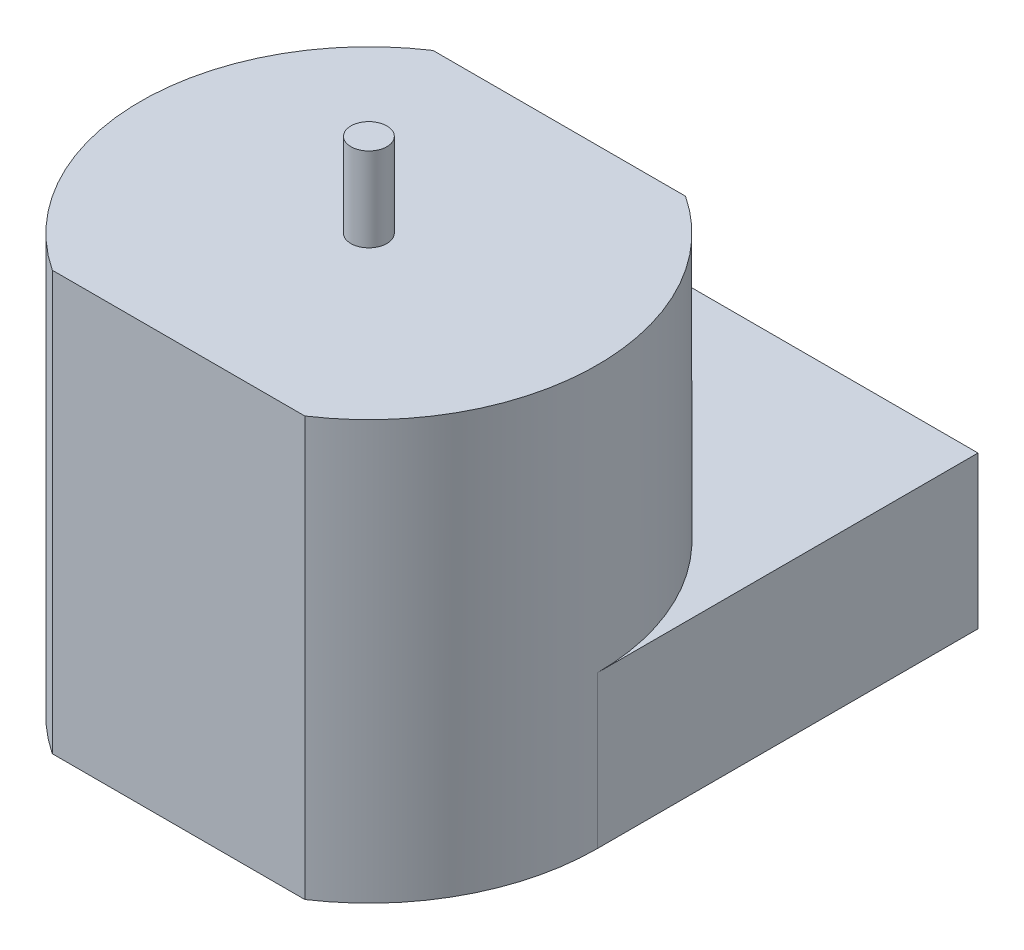
ISO-10303-21;
HEADER;
FILE_DESCRIPTION(('STEP AP214'),'2;1');
FILE_NAME('part.step','',(''),(''),'','','');
FILE_SCHEMA(('AUTOMOTIVE_DESIGN { 1 0 10303 214 1 1 1 1 }'));
ENDSEC;
DATA;
#1=APPLICATION_CONTEXT('core data for automotive mechanical design processes');
#2=APPLICATION_PROTOCOL_DEFINITION('international standard','automotive_design',2000,#1);
#3=PRODUCT_CONTEXT('',#1,'mechanical');
#4=PRODUCT('Part','Part','',(#3));
#5=PRODUCT_RELATED_PRODUCT_CATEGORY('part','',(#4));
#6=PRODUCT_DEFINITION_FORMATION('','',#4);
#7=PRODUCT_DEFINITION_CONTEXT('part definition',#1,'design');
#8=PRODUCT_DEFINITION('design','',#6,#7);
#9=PRODUCT_DEFINITION_SHAPE('','',#8);
#10=(LENGTH_UNIT() NAMED_UNIT(*) SI_UNIT(.MILLI.,.METRE.));
#11=(NAMED_UNIT(*) PLANE_ANGLE_UNIT() SI_UNIT($,.RADIAN.));
#12=(NAMED_UNIT(*) SI_UNIT($,.STERADIAN.) SOLID_ANGLE_UNIT());
#13=UNCERTAINTY_MEASURE_WITH_UNIT(LENGTH_MEASURE(1.E-05),#10,'distance_accuracy_value','');
#14=(GEOMETRIC_REPRESENTATION_CONTEXT(3) GLOBAL_UNCERTAINTY_ASSIGNED_CONTEXT((#13)) GLOBAL_UNIT_ASSIGNED_CONTEXT((#10,
#11,#12)) REPRESENTATION_CONTEXT('',''));
#15=CARTESIAN_POINT('',(0.,0.,0.));
#16=DIRECTION('',(0.,0.,1.));
#17=DIRECTION('',(1.,0.,0.));
#18=AXIS2_PLACEMENT_3D('',#15,#16,#17);
#19=CARTESIAN_POINT('',(0.,6.35,7.9375));
#20=DIRECTION('',(0.,0.,-1.));
#21=DIRECTION('',(-1.,0.,0.));
#22=AXIS2_PLACEMENT_3D('',#19,#20,#21);
#23=PLANE('',#22);
#24=DIRECTION('',(1.,0.,0.));
#25=VECTOR('',#24,1.);
#26=CARTESIAN_POINT('',(0.,0.,7.9375));
#27=LINE('',#26,#25);
#28=CARTESIAN_POINT('',(-5.2651418546892,0.,7.9375));
#29=VERTEX_POINT('',#28);
#30=CARTESIAN_POINT('',(5.2651418546892,0.,7.9375));
#31=VERTEX_POINT('',#30);
#32=EDGE_CURVE('E142',#29,#31,#27,.T.);
#33=ORIENTED_EDGE('',*,*,#32,.T.);
#34=DIRECTION('',(0.,-1.,0.));
#35=VECTOR('',#34,1.);
#36=CARTESIAN_POINT('',(5.2651418546892,6.35,7.9375));
#37=LINE('',#36,#35);
#38=CARTESIAN_POINT('',(5.2651418546892,17.4625,7.9375));
#39=VERTEX_POINT('',#38);
#40=EDGE_CURVE('E39',#39,#31,#37,.T.);
#41=ORIENTED_EDGE('',*,*,#40,.F.);
#42=DIRECTION('',(1.,0.,0.));
#43=VECTOR('',#42,1.);
#44=CARTESIAN_POINT('',(0.,17.4625,7.9375));
#45=LINE('',#44,#43);
#46=CARTESIAN_POINT('',(-5.2651418546892,17.4625,7.9375));
#47=VERTEX_POINT('',#46);
#48=EDGE_CURVE('E117',#47,#39,#45,.T.);
#49=ORIENTED_EDGE('',*,*,#48,.F.);
#50=DIRECTION('',(0.,-1.,0.));
#51=VECTOR('',#50,1.);
#52=CARTESIAN_POINT('',(-5.2651418546892,6.35,7.9375));
#53=LINE('',#52,#51);
#54=EDGE_CURVE('E105',#47,#29,#53,.T.);
#55=ORIENTED_EDGE('',*,*,#54,.T.);
#56=EDGE_LOOP('',(#33,#41,#49,#55));
#57=FACE_BOUND('',#56,.T.);
#58=ADVANCED_FACE('F36',(#57),#23,.F.);
#59=CARTESIAN_POINT('',(0.,6.35,0.));
#60=DIRECTION('',(0.,-1.,0.));
#61=DIRECTION('',(0.,0.,-1.));
#62=AXIS2_PLACEMENT_3D('',#59,#60,#61);
#63=CYLINDRICAL_SURFACE('',#62,9.525);
#64=CARTESIAN_POINT('',(0.,0.,0.));
#65=DIRECTION('',(0.,1.,0.));
#66=DIRECTION('',(0.,0.,1.));
#67=AXIS2_PLACEMENT_3D('',#64,#65,#66);
#68=CIRCLE('',#67,9.525);
#69=CARTESIAN_POINT('',(9.525,0.,0.));
#70=VERTEX_POINT('',#69);
#71=EDGE_CURVE('E149',#31,#70,#68,.T.);
#72=ORIENTED_EDGE('',*,*,#71,.T.);
#73=DIRECTION('',(0.,-1.,0.));
#74=VECTOR('',#73,1.);
#75=CARTESIAN_POINT('',(9.525,6.35,0.));
#76=LINE('',#75,#74);
#77=CARTESIAN_POINT('',(9.525,6.35,0.));
#78=VERTEX_POINT('',#77);
#79=EDGE_CURVE('E165',#78,#70,#76,.T.);
#80=ORIENTED_EDGE('',*,*,#79,.F.);
#81=CARTESIAN_POINT('',(0.,6.35,0.));
#82=DIRECTION('',(0.,1.,0.));
#83=DIRECTION('',(0.,0.,1.));
#84=AXIS2_PLACEMENT_3D('',#81,#82,#83);
#85=CIRCLE('',#84,9.525);
#86=CARTESIAN_POINT('',(5.2651418546892,6.35,-7.9375));
#87=VERTEX_POINT('',#86);
#88=EDGE_CURVE('E11',#78,#87,#85,.T.);
#89=ORIENTED_EDGE('',*,*,#88,.T.);
#90=DIRECTION('',(0.,-1.,0.));
#91=VECTOR('',#90,1.);
#92=CARTESIAN_POINT('',(5.2651418546892,17.4625,-7.9375));
#93=LINE('',#92,#91);
#94=CARTESIAN_POINT('',(5.2651418546892,17.4625,-7.9375));
#95=VERTEX_POINT('',#94);
#96=EDGE_CURVE('E139',#95,#87,#93,.T.);
#97=ORIENTED_EDGE('',*,*,#96,.F.);
#98=CARTESIAN_POINT('',(0.,17.4625,0.));
#99=DIRECTION('',(0.,1.,0.));
#100=DIRECTION('',(0.,0.,1.));
#101=AXIS2_PLACEMENT_3D('',#98,#99,#100);
#102=CIRCLE('',#101,9.525);
#103=EDGE_CURVE('E121',#39,#95,#102,.T.);
#104=ORIENTED_EDGE('',*,*,#103,.F.);
#105=ORIENTED_EDGE('',*,*,#40,.T.);
#106=EDGE_LOOP('',(#72,#80,#89,#97,#104,#105));
#107=FACE_BOUND('',#106,.T.);
#108=ADVANCED_FACE('F171',(#107),#63,.T.);
#109=CARTESIAN_POINT('',(9.525,6.35,0.));
#110=DIRECTION('',(-1.,0.,0.));
#111=DIRECTION('',(0.,0.,1.));
#112=AXIS2_PLACEMENT_3D('',#109,#110,#111);
#113=PLANE('',#112);
#114=DIRECTION('',(0.,0.,-1.));
#115=VECTOR('',#114,1.);
#116=CARTESIAN_POINT('',(9.525,0.,0.));
#117=LINE('',#116,#115);
#118=CARTESIAN_POINT('',(9.525,0.,-15.875));
#119=VERTEX_POINT('',#118);
#120=EDGE_CURVE('E151',#70,#119,#117,.T.);
#121=ORIENTED_EDGE('',*,*,#120,.T.);
#122=DIRECTION('',(0.,-1.,0.));
#123=VECTOR('',#122,1.);
#124=CARTESIAN_POINT('',(9.525,6.35,-15.875));
#125=LINE('',#124,#123);
#126=CARTESIAN_POINT('',(9.525,6.35,-15.875));
#127=VERTEX_POINT('',#126);
#128=EDGE_CURVE('E163',#127,#119,#125,.T.);
#129=ORIENTED_EDGE('',*,*,#128,.F.);
#130=DIRECTION('',(0.,0.,-1.));
#131=VECTOR('',#130,1.);
#132=CARTESIAN_POINT('',(9.525,6.35,0.));
#133=LINE('',#132,#131);
#134=EDGE_CURVE('E143',#78,#127,#133,.T.);
#135=ORIENTED_EDGE('',*,*,#134,.F.);
#136=ORIENTED_EDGE('',*,*,#79,.T.);
#137=EDGE_LOOP('',(#121,#129,#135,#136));
#138=FACE_BOUND('',#137,.T.);
#139=ADVANCED_FACE('F177',(#138),#113,.F.);
#140=CARTESIAN_POINT('',(0.,6.35,-15.875));
#141=DIRECTION('',(0.,0.,1.));
#142=DIRECTION('',(1.,0.,0.));
#143=AXIS2_PLACEMENT_3D('',#140,#141,#142);
#144=PLANE('',#143);
#145=DIRECTION('',(-1.,0.,0.));
#146=VECTOR('',#145,1.);
#147=CARTESIAN_POINT('',(0.,0.,-15.875));
#148=LINE('',#147,#146);
#149=CARTESIAN_POINT('',(-9.525,0.,-15.875));
#150=VERTEX_POINT('',#149);
#151=EDGE_CURVE('E153',#119,#150,#148,.T.);
#152=ORIENTED_EDGE('',*,*,#151,.T.);
#153=DIRECTION('',(0.,-1.,0.));
#154=VECTOR('',#153,1.);
#155=CARTESIAN_POINT('',(-9.525,6.35,-15.875));
#156=LINE('',#155,#154);
#157=CARTESIAN_POINT('',(-9.525,6.35,-15.875));
#158=VERTEX_POINT('',#157);
#159=EDGE_CURVE('E161',#158,#150,#156,.T.);
#160=ORIENTED_EDGE('',*,*,#159,.F.);
#161=DIRECTION('',(-1.,0.,0.));
#162=VECTOR('',#161,1.);
#163=CARTESIAN_POINT('',(0.,6.35,-15.875));
#164=LINE('',#163,#162);
#165=EDGE_CURVE('E145',#127,#158,#164,.T.);
#166=ORIENTED_EDGE('',*,*,#165,.F.);
#167=ORIENTED_EDGE('',*,*,#128,.T.);
#168=EDGE_LOOP('',(#152,#160,#166,#167));
#169=FACE_BOUND('',#168,.T.);
#170=ADVANCED_FACE('F180',(#169),#144,.F.);
#171=CARTESIAN_POINT('',(-9.525,6.35,0.));
#172=DIRECTION('',(-1.,0.,0.));
#173=DIRECTION('',(0.,0.,1.));
#174=AXIS2_PLACEMENT_3D('',#171,#172,#173);
#175=PLANE('',#174);
#176=DIRECTION('',(0.,0.,-1.));
#177=VECTOR('',#176,1.);
#178=CARTESIAN_POINT('',(-9.525,0.,0.));
#179=LINE('',#178,#177);
#180=CARTESIAN_POINT('',(-9.525,0.,0.));
#181=VERTEX_POINT('',#180);
#182=EDGE_CURVE('E156',#181,#150,#179,.T.);
#183=ORIENTED_EDGE('',*,*,#182,.F.);
#184=DIRECTION('',(0.,-1.,0.));
#185=VECTOR('',#184,1.);
#186=CARTESIAN_POINT('',(-9.525,6.35,0.));
#187=LINE('',#186,#185);
#188=CARTESIAN_POINT('',(-9.525,6.35,0.));
#189=VERTEX_POINT('',#188);
#190=EDGE_CURVE('E60',#189,#181,#187,.T.);
#191=ORIENTED_EDGE('',*,*,#190,.F.);
#192=DIRECTION('',(0.,0.,-1.));
#193=VECTOR('',#192,1.);
#194=CARTESIAN_POINT('',(-9.525,6.35,0.));
#195=LINE('',#194,#193);
#196=EDGE_CURVE('E114',#189,#158,#195,.T.);
#197=ORIENTED_EDGE('',*,*,#196,.T.);
#198=ORIENTED_EDGE('',*,*,#159,.T.);
#199=EDGE_LOOP('',(#183,#191,#197,#198));
#200=FACE_BOUND('',#199,.T.);
#201=ADVANCED_FACE('F208',(#200),#175,.T.);
#202=CARTESIAN_POINT('',(0.,6.35,0.));
#203=DIRECTION('',(0.,-1.,0.));
#204=DIRECTION('',(0.,0.,-1.));
#205=AXIS2_PLACEMENT_3D('',#202,#203,#204);
#206=CYLINDRICAL_SURFACE('',#205,9.525);
#207=CARTESIAN_POINT('',(0.,0.,0.));
#208=DIRECTION('',(0.,1.,0.));
#209=DIRECTION('',(0.,0.,1.));
#210=AXIS2_PLACEMENT_3D('',#207,#208,#209);
#211=CIRCLE('',#210,9.525);
#212=EDGE_CURVE('E86',#181,#29,#211,.T.);
#213=ORIENTED_EDGE('',*,*,#212,.T.);
#214=ORIENTED_EDGE('',*,*,#54,.F.);
#215=CARTESIAN_POINT('',(0.,17.4625,0.));
#216=DIRECTION('',(0.,1.,0.));
#217=DIRECTION('',(0.,0.,1.));
#218=AXIS2_PLACEMENT_3D('',#215,#216,#217);
#219=CIRCLE('',#218,9.525);
#220=CARTESIAN_POINT('',(-5.2651418546892,17.4625,-7.9375));
#221=VERTEX_POINT('',#220);
#222=EDGE_CURVE('E109',#221,#47,#219,.T.);
#223=ORIENTED_EDGE('',*,*,#222,.F.);
#224=DIRECTION('',(0.,-1.,0.));
#225=VECTOR('',#224,1.);
#226=CARTESIAN_POINT('',(-5.2651418546892,17.4625,-7.9375));
#227=LINE('',#226,#225);
#228=CARTESIAN_POINT('',(-5.2651418546892,6.35,-7.9375));
#229=VERTEX_POINT('',#228);
#230=EDGE_CURVE('E135',#221,#229,#227,.T.);
#231=ORIENTED_EDGE('',*,*,#230,.T.);
#232=CARTESIAN_POINT('',(0.,6.35,0.));
#233=DIRECTION('',(0.,1.,0.));
#234=DIRECTION('',(0.,0.,1.));
#235=AXIS2_PLACEMENT_3D('',#232,#233,#234);
#236=CIRCLE('',#235,9.525);
#237=EDGE_CURVE('E51',#229,#189,#236,.T.);
#238=ORIENTED_EDGE('',*,*,#237,.T.);
#239=ORIENTED_EDGE('',*,*,#190,.T.);
#240=EDGE_LOOP('',(#213,#214,#223,#231,#238,#239));
#241=FACE_BOUND('',#240,.T.);
#242=ADVANCED_FACE('F107',(#241),#206,.T.);
#243=CARTESIAN_POINT('',(0.,6.35,0.));
#244=DIRECTION('',(0.,1.,0.));
#245=DIRECTION('',(0.,0.,1.));
#246=AXIS2_PLACEMENT_3D('',#243,#244,#245);
#247=PLANE('',#246);
#248=ORIENTED_EDGE('',*,*,#237,.F.);
#249=DIRECTION('',(1.,0.,0.));
#250=VECTOR('',#249,1.);
#251=CARTESIAN_POINT('',(0.,6.35,-7.9375));
#252=LINE('',#251,#250);
#253=EDGE_CURVE('E126',#229,#87,#252,.T.);
#254=ORIENTED_EDGE('',*,*,#253,.T.);
#255=ORIENTED_EDGE('',*,*,#88,.F.);
#256=ORIENTED_EDGE('',*,*,#134,.T.);
#257=ORIENTED_EDGE('',*,*,#165,.T.);
#258=ORIENTED_EDGE('',*,*,#196,.F.);
#259=EDGE_LOOP('',(#248,#254,#255,#256,#257,#258));
#260=FACE_BOUND('',#259,.T.);
#261=ADVANCED_FACE('F182',(#260),#247,.T.);
#262=CARTESIAN_POINT('',(0.,0.,0.));
#263=DIRECTION('',(0.,1.,0.));
#264=DIRECTION('',(0.,0.,1.));
#265=AXIS2_PLACEMENT_3D('',#262,#263,#264);
#266=PLANE('',#265);
#267=ORIENTED_EDGE('',*,*,#32,.F.);
#268=ORIENTED_EDGE('',*,*,#212,.F.);
#269=ORIENTED_EDGE('',*,*,#182,.T.);
#270=ORIENTED_EDGE('',*,*,#151,.F.);
#271=ORIENTED_EDGE('',*,*,#120,.F.);
#272=ORIENTED_EDGE('',*,*,#71,.F.);
#273=EDGE_LOOP('',(#267,#268,#269,#270,#271,#272));
#274=FACE_BOUND('',#273,.T.);
#275=ADVANCED_FACE('F174',(#274),#266,.F.);
#276=CARTESIAN_POINT('',(0.,17.4625,-7.9375));
#277=DIRECTION('',(0.,0.,-1.));
#278=DIRECTION('',(-1.,0.,0.));
#279=AXIS2_PLACEMENT_3D('',#276,#277,#278);
#280=PLANE('',#279);
#281=ORIENTED_EDGE('',*,*,#253,.F.);
#282=ORIENTED_EDGE('',*,*,#230,.F.);
#283=DIRECTION('',(1.,0.,0.));
#284=VECTOR('',#283,1.);
#285=CARTESIAN_POINT('',(0.,17.4625,-7.9375));
#286=LINE('',#285,#284);
#287=EDGE_CURVE('E125',#221,#95,#286,.T.);
#288=ORIENTED_EDGE('',*,*,#287,.T.);
#289=ORIENTED_EDGE('',*,*,#96,.T.);
#290=EDGE_LOOP('',(#281,#282,#288,#289));
#291=FACE_BOUND('',#290,.T.);
#292=ADVANCED_FACE('F185',(#291),#280,.T.);
#293=CARTESIAN_POINT('',(0.,17.4625,0.));
#294=DIRECTION('',(0.,1.,0.));
#295=DIRECTION('',(0.,0.,1.));
#296=AXIS2_PLACEMENT_3D('',#293,#294,#295);
#297=PLANE('',#296);
#298=CARTESIAN_POINT('',(0.,17.4625,0.));
#299=DIRECTION('',(0.,1.,0.));
#300=DIRECTION('',(0.,0.,1.));
#301=AXIS2_PLACEMENT_3D('',#298,#299,#300);
#302=CIRCLE('',#301,0.75);
#303=CARTESIAN_POINT('',(0.,17.4625,0.75));
#304=VERTEX_POINT('',#303);
#305=EDGE_CURVE('E130',#304,#304,#302,.T.);
#306=ORIENTED_EDGE('',*,*,#305,.F.);
#307=EDGE_LOOP('',(#306));
#308=FACE_BOUND('',#307,.T.);
#309=ORIENTED_EDGE('',*,*,#222,.T.);
#310=ORIENTED_EDGE('',*,*,#48,.T.);
#311=ORIENTED_EDGE('',*,*,#103,.T.);
#312=ORIENTED_EDGE('',*,*,#287,.F.);
#313=EDGE_LOOP('',(#309,#310,#311,#312));
#314=FACE_BOUND('',#313,.T.);
#315=ADVANCED_FACE('F123',(#308,#314),#297,.T.);
#316=CARTESIAN_POINT('',(0.,20.9625,0.));
#317=DIRECTION('',(0.,-1.,0.));
#318=DIRECTION('',(0.,0.,-1.));
#319=AXIS2_PLACEMENT_3D('',#316,#317,#318);
#320=CYLINDRICAL_SURFACE('',#319,0.75);
#321=CARTESIAN_POINT('',(0.,20.9625,0.));
#322=DIRECTION('',(0.,1.,0.));
#323=DIRECTION('',(0.,0.,1.));
#324=AXIS2_PLACEMENT_3D('',#321,#322,#323);
#325=CIRCLE('',#324,0.75);
#326=CARTESIAN_POINT('',(0.,20.9625,0.75));
#327=VERTEX_POINT('',#326);
#328=EDGE_CURVE('E136',#327,#327,#325,.T.);
#329=ORIENTED_EDGE('',*,*,#328,.F.);
#330=EDGE_LOOP('',(#329));
#331=FACE_BOUND('',#330,.T.);
#332=ORIENTED_EDGE('',*,*,#305,.T.);
#333=EDGE_LOOP('',(#332));
#334=FACE_BOUND('',#333,.T.);
#335=ADVANCED_FACE('F192',(#331,#334),#320,.T.);
#336=CARTESIAN_POINT('',(0.,20.9625,0.));
#337=DIRECTION('',(0.,1.,0.));
#338=DIRECTION('',(0.,0.,1.));
#339=AXIS2_PLACEMENT_3D('',#336,#337,#338);
#340=PLANE('',#339);
#341=ORIENTED_EDGE('',*,*,#328,.T.);
#342=EDGE_LOOP('',(#341));
#343=FACE_BOUND('',#342,.T.);
#344=ADVANCED_FACE('F281',(#343),#340,.T.);
#345=CLOSED_SHELL('',(#58,#108,#139,#170,#201,#242,#261,#275,#292,#315,#335,#344));
#346=MANIFOLD_SOLID_BREP('B2',#345);
#347=ADVANCED_BREP_SHAPE_REPRESENTATION('',(#18,#346),#14);
#348=SHAPE_DEFINITION_REPRESENTATION(#9,#347);
ENDSEC;
END-ISO-10303-21;
